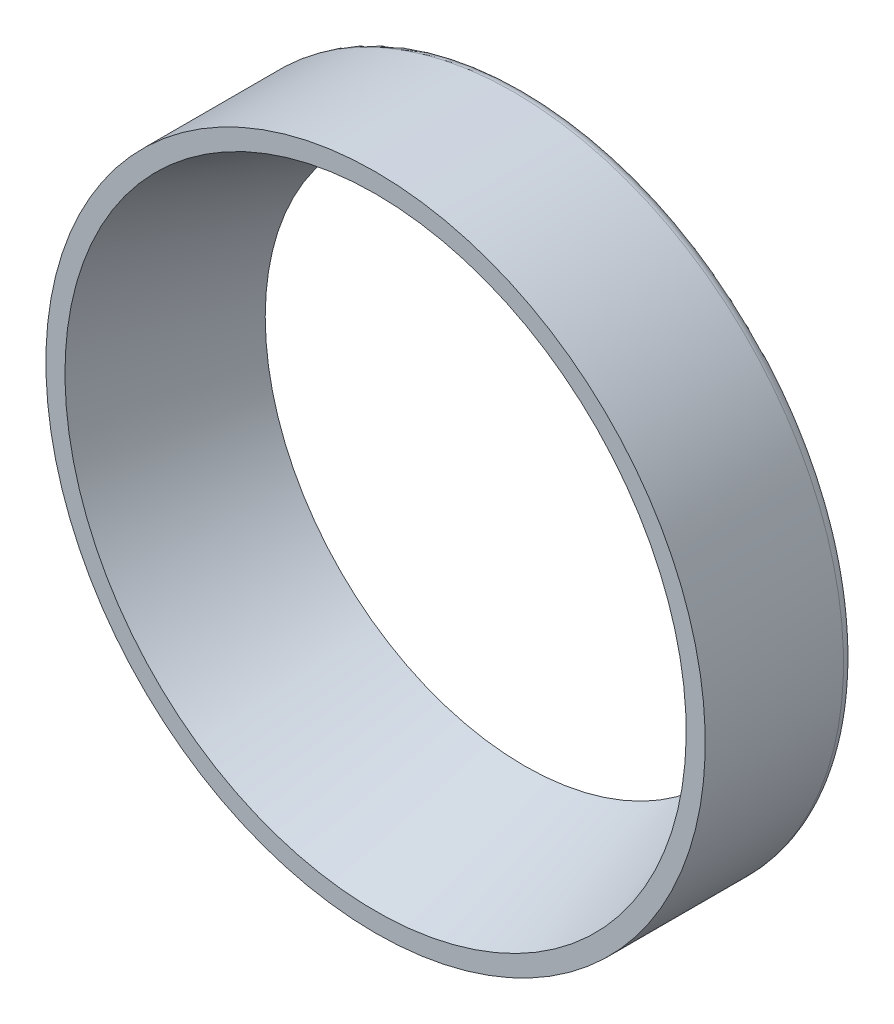
ISO-10303-21;
HEADER;
FILE_DESCRIPTION(('STEP AP214'),'2;1');
FILE_NAME('part.step','',(''),(''),'','','');
FILE_SCHEMA(('AUTOMOTIVE_DESIGN { 1 0 10303 214 1 1 1 1 }'));
ENDSEC;
DATA;
#1=APPLICATION_CONTEXT('core data for automotive mechanical design processes');
#2=APPLICATION_PROTOCOL_DEFINITION('international standard','automotive_design',2000,#1);
#3=PRODUCT_CONTEXT('',#1,'mechanical');
#4=PRODUCT('Part','Part','',(#3));
#5=PRODUCT_RELATED_PRODUCT_CATEGORY('part','',(#4));
#6=PRODUCT_DEFINITION_FORMATION('','',#4);
#7=PRODUCT_DEFINITION_CONTEXT('part definition',#1,'design');
#8=PRODUCT_DEFINITION('design','',#6,#7);
#9=PRODUCT_DEFINITION_SHAPE('','',#8);
#10=(LENGTH_UNIT() NAMED_UNIT(*) SI_UNIT(.MILLI.,.METRE.));
#11=(NAMED_UNIT(*) PLANE_ANGLE_UNIT() SI_UNIT($,.RADIAN.));
#12=(NAMED_UNIT(*) SI_UNIT($,.STERADIAN.) SOLID_ANGLE_UNIT());
#13=UNCERTAINTY_MEASURE_WITH_UNIT(LENGTH_MEASURE(1.E-05),#10,'distance_accuracy_value','');
#14=(GEOMETRIC_REPRESENTATION_CONTEXT(3) GLOBAL_UNCERTAINTY_ASSIGNED_CONTEXT((#13)) GLOBAL_UNIT_ASSIGNED_CONTEXT((#10,
#11,#12)) REPRESENTATION_CONTEXT('',''));
#15=CARTESIAN_POINT('',(0.,0.,0.));
#16=DIRECTION('',(0.,0.,1.));
#17=DIRECTION('',(1.,0.,0.));
#18=AXIS2_PLACEMENT_3D('',#15,#16,#17);
#19=CARTESIAN_POINT('',(0.,0.,9.08781410989478));
#20=DIRECTION('',(0.,0.,1.));
#21=DIRECTION('',(0.,1.,0.));
#22=AXIS2_PLACEMENT_3D('',#19,#20,#21);
#23=CONICAL_SURFACE('',#22,27.9433476919721,0.33224087640964);
#24=CARTESIAN_POINT('',(0.,0.,12.75));
#25=DIRECTION('',(0.,0.,-1.));
#26=DIRECTION('',(0.,1.,0.));
#27=AXIS2_PLACEMENT_3D('',#24,#25,#26);
#28=CIRCLE('',#27,29.2069138078009);
#29=CARTESIAN_POINT('',(0.,29.2069138078009,12.75));
#30=VERTEX_POINT('',#29);
#31=EDGE_CURVE('E11',#30,#30,#28,.T.);
#32=ORIENTED_EDGE('',*,*,#31,.F.);
#33=EDGE_LOOP('',(#32));
#34=FACE_BOUND('',#33,.T.);
#35=CARTESIAN_POINT('',(0.,0.,-1.25));
#36=DIRECTION('',(0.,0.,-1.));
#37=DIRECTION('',(0.,1.,0.));
#38=AXIS2_PLACEMENT_3D('',#35,#36,#37);
#39=CIRCLE('',#38,24.3764857103637);
#40=CARTESIAN_POINT('',(0.,24.3764857103637,-1.25));
#41=VERTEX_POINT('',#40);
#42=EDGE_CURVE('E28',#41,#41,#39,.T.);
#43=ORIENTED_EDGE('',*,*,#42,.T.);
#44=EDGE_LOOP('',(#43));
#45=FACE_BOUND('',#44,.T.);
#46=ADVANCED_FACE('F17',(#34,#45),#23,.F.);
#47=CARTESIAN_POINT('',(0.,30.1034569039003,12.75));
#48=DIRECTION('',(0.,0.,1.));
#49=DIRECTION('',(1.,0.,0.));
#50=AXIS2_PLACEMENT_3D('',#47,#48,#49);
#51=PLANE('',#50);
#52=ORIENTED_EDGE('',*,*,#31,.T.);
#53=EDGE_LOOP('',(#52));
#54=FACE_BOUND('',#53,.T.);
#55=CARTESIAN_POINT('',(0.,0.,12.75));
#56=DIRECTION('',(0.,0.,-1.));
#57=DIRECTION('',(0.,1.,0.));
#58=AXIS2_PLACEMENT_3D('',#55,#56,#57);
#59=CIRCLE('',#58,31.);
#60=CARTESIAN_POINT('',(0.,31.,12.75));
#61=VERTEX_POINT('',#60);
#62=EDGE_CURVE('E21',#61,#61,#59,.T.);
#63=ORIENTED_EDGE('',*,*,#62,.F.);
#64=EDGE_LOOP('',(#63));
#65=FACE_BOUND('',#64,.T.);
#66=ADVANCED_FACE('F83',(#54,#65),#51,.T.);
#67=CARTESIAN_POINT('',(0.,27.6882428551819,-1.25));
#68=DIRECTION('',(0.,0.,-1.));
#69=DIRECTION('',(-1.,0.,0.));
#70=AXIS2_PLACEMENT_3D('',#67,#68,#69);
#71=PLANE('',#70);
#72=ORIENTED_EDGE('',*,*,#42,.F.);
#73=EDGE_LOOP('',(#72));
#74=FACE_BOUND('',#73,.T.);
#75=CARTESIAN_POINT('',(0.,0.,-1.25));
#76=DIRECTION('',(0.,0.,1.));
#77=DIRECTION('',(0.,-1.,0.));
#78=AXIS2_PLACEMENT_3D('',#75,#76,#77);
#79=CIRCLE('',#78,30.);
#80=CARTESIAN_POINT('',(0.,-30.,-1.25));
#81=VERTEX_POINT('',#80);
#82=EDGE_CURVE('E61',#81,#81,#79,.T.);
#83=ORIENTED_EDGE('',*,*,#82,.F.);
#84=EDGE_LOOP('',(#83));
#85=FACE_BOUND('',#84,.T.);
#86=ADVANCED_FACE('F77',(#74,#85),#71,.T.);
#87=CARTESIAN_POINT('',(0.,0.,5.75));
#88=DIRECTION('',(0.,0.,-1.));
#89=DIRECTION('',(0.,1.,0.));
#90=AXIS2_PLACEMENT_3D('',#87,#88,#89);
#91=CYLINDRICAL_SURFACE('',#90,31.);
#92=ORIENTED_EDGE('',*,*,#62,.T.);
#93=EDGE_LOOP('',(#92));
#94=FACE_BOUND('',#93,.T.);
#95=CARTESIAN_POINT('',(0.,0.,-0.25));
#96=DIRECTION('',(0.,0.,-1.));
#97=DIRECTION('',(0.,-1.,0.));
#98=AXIS2_PLACEMENT_3D('',#95,#96,#97);
#99=CIRCLE('',#98,31.);
#100=CARTESIAN_POINT('',(0.,-31.,-0.25));
#101=VERTEX_POINT('',#100);
#102=EDGE_CURVE('E54',#101,#101,#99,.T.);
#103=ORIENTED_EDGE('',*,*,#102,.F.);
#104=EDGE_LOOP('',(#103));
#105=FACE_BOUND('',#104,.T.);
#106=ADVANCED_FACE('F82',(#94,#105),#91,.T.);
#107=CARTESIAN_POINT('',(0.,0.,-0.25));
#108=DIRECTION('',(0.,0.,-1.));
#109=DIRECTION('',(-1.,0.,0.));
#110=AXIS2_PLACEMENT_3D('',#107,#108,#109);
#111=TOROIDAL_SURFACE('',#110,30.,1.);
#112=ORIENTED_EDGE('',*,*,#102,.T.);
#113=EDGE_LOOP('',(#112));
#114=FACE_BOUND('',#113,.T.);
#115=ORIENTED_EDGE('',*,*,#82,.T.);
#116=EDGE_LOOP('',(#115));
#117=FACE_BOUND('',#116,.T.);
#118=ADVANCED_FACE('F19',(#114,#117),#111,.T.);
#119=CLOSED_SHELL('',(#46,#66,#86,#106,#118));
#120=MANIFOLD_SOLID_BREP('B1',#119);
#121=ADVANCED_BREP_SHAPE_REPRESENTATION('',(#18,#120),#14);
#122=SHAPE_DEFINITION_REPRESENTATION(#9,#121);
ENDSEC;
END-ISO-10303-21;
